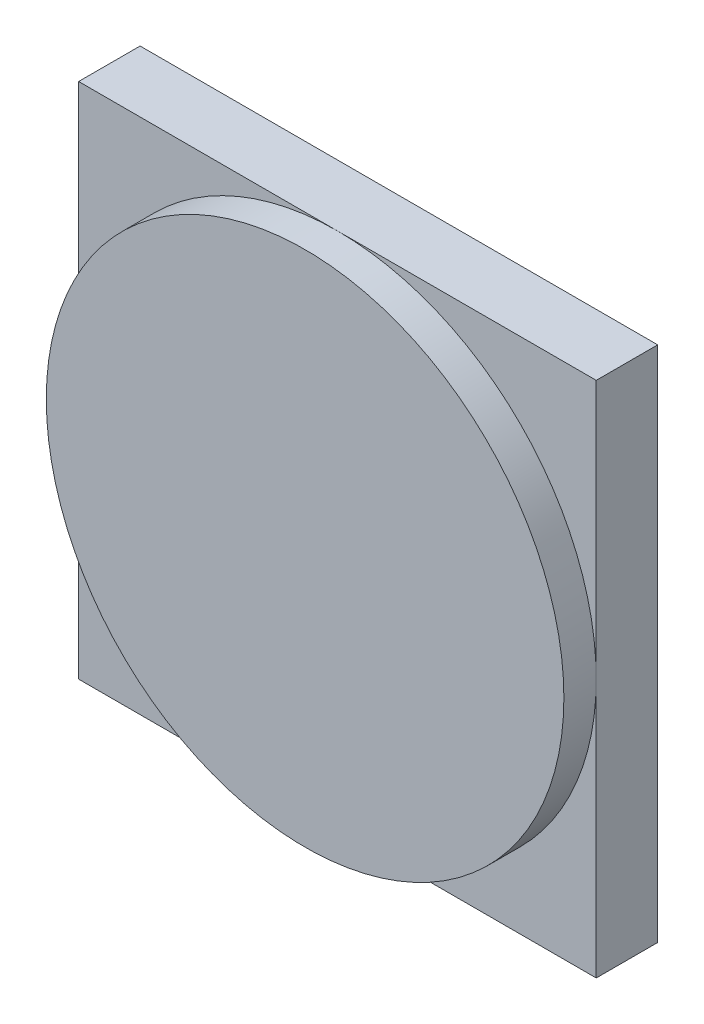
ISO-10303-21;
HEADER;
FILE_DESCRIPTION(('STEP AP214'),'2;1');
FILE_NAME('part.step','',(''),(''),'','','');
FILE_SCHEMA(('AUTOMOTIVE_DESIGN { 1 0 10303 214 1 1 1 1 }'));
ENDSEC;
DATA;
#1=APPLICATION_CONTEXT('core data for automotive mechanical design processes');
#2=APPLICATION_PROTOCOL_DEFINITION('international standard','automotive_design',2000,#1);
#3=PRODUCT_CONTEXT('',#1,'mechanical');
#4=PRODUCT('Part','Part','',(#3));
#5=PRODUCT_RELATED_PRODUCT_CATEGORY('part','',(#4));
#6=PRODUCT_DEFINITION_FORMATION('','',#4);
#7=PRODUCT_DEFINITION_CONTEXT('part definition',#1,'design');
#8=PRODUCT_DEFINITION('design','',#6,#7);
#9=PRODUCT_DEFINITION_SHAPE('','',#8);
#10=(LENGTH_UNIT() NAMED_UNIT(*) SI_UNIT(.MILLI.,.METRE.));
#11=(NAMED_UNIT(*) PLANE_ANGLE_UNIT() SI_UNIT($,.RADIAN.));
#12=(NAMED_UNIT(*) SI_UNIT($,.STERADIAN.) SOLID_ANGLE_UNIT());
#13=UNCERTAINTY_MEASURE_WITH_UNIT(LENGTH_MEASURE(1.E-05),#10,'distance_accuracy_value','');
#14=(GEOMETRIC_REPRESENTATION_CONTEXT(3) GLOBAL_UNCERTAINTY_ASSIGNED_CONTEXT((#13)) GLOBAL_UNIT_ASSIGNED_CONTEXT((#10,
#11,#12)) REPRESENTATION_CONTEXT('',''));
#15=CARTESIAN_POINT('',(0.,0.,0.));
#16=DIRECTION('',(0.,0.,1.));
#17=DIRECTION('',(1.,0.,0.));
#18=AXIS2_PLACEMENT_3D('',#15,#16,#17);
#19=CARTESIAN_POINT('',(0.,0.,5.));
#20=DIRECTION('',(0.,0.,-1.));
#21=DIRECTION('',(-1.,0.,0.));
#22=AXIS2_PLACEMENT_3D('',#19,#20,#21);
#23=CYLINDRICAL_SURFACE('',#22,40.);
#24=CARTESIAN_POINT('',(0.,0.,5.));
#25=DIRECTION('',(0.,0.,1.));
#26=DIRECTION('',(1.,0.,0.));
#27=AXIS2_PLACEMENT_3D('',#24,#25,#26);
#28=CIRCLE('',#27,40.);
#29=CARTESIAN_POINT('',(40.,0.,5.));
#30=VERTEX_POINT('',#29);
#31=EDGE_CURVE('E11',#30,#30,#28,.T.);
#32=ORIENTED_EDGE('',*,*,#31,.F.);
#33=EDGE_LOOP('',(#32));
#34=FACE_BOUND('',#33,.T.);
#35=CARTESIAN_POINT('',(0.,0.,0.));
#36=DIRECTION('',(0.,0.,1.));
#37=DIRECTION('',(1.,0.,0.));
#38=AXIS2_PLACEMENT_3D('',#35,#36,#37);
#39=CIRCLE('',#38,40.);
#40=CARTESIAN_POINT('',(40.,0.,0.));
#41=VERTEX_POINT('',#40);
#42=CARTESIAN_POINT('',(0.,40.,0.));
#43=VERTEX_POINT('',#42);
#44=EDGE_CURVE('E48',#41,#43,#39,.T.);
#45=ORIENTED_EDGE('',*,*,#44,.T.);
#46=CARTESIAN_POINT('',(-40.,0.,0.));
#47=VERTEX_POINT('',#46);
#48=EDGE_CURVE('E68',#43,#47,#39,.T.);
#49=ORIENTED_EDGE('',*,*,#48,.T.);
#50=CARTESIAN_POINT('',(0.,-40.,0.));
#51=VERTEX_POINT('',#50);
#52=EDGE_CURVE('E133',#47,#51,#39,.T.);
#53=ORIENTED_EDGE('',*,*,#52,.T.);
#54=EDGE_CURVE('E128',#51,#41,#39,.T.);
#55=ORIENTED_EDGE('',*,*,#54,.T.);
#56=EDGE_LOOP('',(#45,#49,#53,#55));
#57=FACE_BOUND('',#56,.T.);
#58=ADVANCED_FACE('F45',(#34,#57),#23,.T.);
#59=CARTESIAN_POINT('',(0.,0.,5.));
#60=DIRECTION('',(0.,0.,1.));
#61=DIRECTION('',(1.,0.,0.));
#62=AXIS2_PLACEMENT_3D('',#59,#60,#61);
#63=PLANE('',#62);
#64=ORIENTED_EDGE('',*,*,#31,.T.);
#65=EDGE_LOOP('',(#64));
#66=FACE_BOUND('',#65,.T.);
#67=ADVANCED_FACE('F192',(#66),#63,.T.);
#68=CARTESIAN_POINT('',(0.,0.,0.));
#69=DIRECTION('',(0.,0.,-1.));
#70=DIRECTION('',(-1.,0.,0.));
#71=AXIS2_PLACEMENT_3D('',#68,#69,#70);
#72=PLANE('',#71);
#73=ORIENTED_EDGE('',*,*,#44,.F.);
#74=DIRECTION('',(0.,-1.,0.));
#75=VECTOR('',#74,1.);
#76=CARTESIAN_POINT('',(40.,-40.,0.));
#77=LINE('',#76,#75);
#78=CARTESIAN_POINT('',(40.,40.,0.));
#79=VERTEX_POINT('',#78);
#80=EDGE_CURVE('E60',#79,#41,#77,.T.);
#81=ORIENTED_EDGE('',*,*,#80,.F.);
#82=DIRECTION('',(1.,0.,0.));
#83=VECTOR('',#82,1.);
#84=CARTESIAN_POINT('',(-40.,40.,0.));
#85=LINE('',#84,#83);
#86=EDGE_CURVE('E153',#43,#79,#85,.T.);
#87=ORIENTED_EDGE('',*,*,#86,.F.);
#88=EDGE_LOOP('',(#73,#81,#87));
#89=FACE_BOUND('',#88,.T.);
#90=ADVANCED_FACE('F180',(#89),#72,.F.);
#91=ORIENTED_EDGE('',*,*,#48,.F.);
#92=CARTESIAN_POINT('',(-40.,40.,0.));
#93=VERTEX_POINT('',#92);
#94=EDGE_CURVE('E150',#93,#43,#85,.T.);
#95=ORIENTED_EDGE('',*,*,#94,.F.);
#96=DIRECTION('',(0.,1.,0.));
#97=VECTOR('',#96,1.);
#98=CARTESIAN_POINT('',(-40.,-40.,0.));
#99=LINE('',#98,#97);
#100=EDGE_CURVE('E126',#47,#93,#99,.T.);
#101=ORIENTED_EDGE('',*,*,#100,.F.);
#102=EDGE_LOOP('',(#91,#95,#101));
#103=FACE_BOUND('',#102,.T.);
#104=ADVANCED_FACE('F172',(#103),#72,.F.);
#105=ORIENTED_EDGE('',*,*,#52,.F.);
#106=CARTESIAN_POINT('',(-40.,-40.,0.));
#107=VERTEX_POINT('',#106);
#108=EDGE_CURVE('E154',#107,#47,#99,.T.);
#109=ORIENTED_EDGE('',*,*,#108,.F.);
#110=DIRECTION('',(-1.,0.,0.));
#111=VECTOR('',#110,1.);
#112=CARTESIAN_POINT('',(-40.,-40.,0.));
#113=LINE('',#112,#111);
#114=EDGE_CURVE('E146',#51,#107,#113,.T.);
#115=ORIENTED_EDGE('',*,*,#114,.F.);
#116=EDGE_LOOP('',(#105,#109,#115));
#117=FACE_BOUND('',#116,.T.);
#118=ADVANCED_FACE('F168',(#117),#72,.F.);
#119=CARTESIAN_POINT('',(-40.,-40.,-9.5));
#120=DIRECTION('',(1.,0.,0.));
#121=DIRECTION('',(0.,1.,0.));
#122=AXIS2_PLACEMENT_3D('',#119,#120,#121);
#123=PLANE('',#122);
#124=ORIENTED_EDGE('',*,*,#108,.T.);
#125=ORIENTED_EDGE('',*,*,#100,.T.);
#126=DIRECTION('',(0.,0.,1.));
#127=VECTOR('',#126,1.);
#128=CARTESIAN_POINT('',(-40.,40.,-9.5));
#129=LINE('',#128,#127);
#130=CARTESIAN_POINT('',(-40.,40.,-9.5));
#131=VERTEX_POINT('',#130);
#132=EDGE_CURVE('E106',#131,#93,#129,.T.);
#133=ORIENTED_EDGE('',*,*,#132,.F.);
#134=DIRECTION('',(0.,1.,0.));
#135=VECTOR('',#134,1.);
#136=CARTESIAN_POINT('',(-40.,-40.,-9.5));
#137=LINE('',#136,#135);
#138=CARTESIAN_POINT('',(-40.,-40.,-9.5));
#139=VERTEX_POINT('',#138);
#140=EDGE_CURVE('E112',#139,#131,#137,.T.);
#141=ORIENTED_EDGE('',*,*,#140,.F.);
#142=DIRECTION('',(0.,0.,1.));
#143=VECTOR('',#142,1.);
#144=CARTESIAN_POINT('',(-40.,-40.,-9.5));
#145=LINE('',#144,#143);
#146=EDGE_CURVE('E140',#139,#107,#145,.T.);
#147=ORIENTED_EDGE('',*,*,#146,.T.);
#148=EDGE_LOOP('',(#124,#125,#133,#141,#147));
#149=FACE_BOUND('',#148,.T.);
#150=ADVANCED_FACE('F125',(#149),#123,.F.);
#151=CARTESIAN_POINT('',(-40.,40.,-9.5));
#152=DIRECTION('',(0.,-1.,0.));
#153=DIRECTION('',(0.,0.,-1.));
#154=AXIS2_PLACEMENT_3D('',#151,#152,#153);
#155=PLANE('',#154);
#156=ORIENTED_EDGE('',*,*,#94,.T.);
#157=ORIENTED_EDGE('',*,*,#86,.T.);
#158=DIRECTION('',(0.,0.,1.));
#159=VECTOR('',#158,1.);
#160=CARTESIAN_POINT('',(40.,40.,-9.5));
#161=LINE('',#160,#159);
#162=CARTESIAN_POINT('',(40.,40.,-9.5));
#163=VERTEX_POINT('',#162);
#164=EDGE_CURVE('E107',#163,#79,#161,.T.);
#165=ORIENTED_EDGE('',*,*,#164,.F.);
#166=DIRECTION('',(1.,0.,0.));
#167=VECTOR('',#166,1.);
#168=CARTESIAN_POINT('',(-40.,40.,-9.5));
#169=LINE('',#168,#167);
#170=EDGE_CURVE('E101',#131,#163,#169,.T.);
#171=ORIENTED_EDGE('',*,*,#170,.F.);
#172=ORIENTED_EDGE('',*,*,#132,.T.);
#173=EDGE_LOOP('',(#156,#157,#165,#171,#172));
#174=FACE_BOUND('',#173,.T.);
#175=ADVANCED_FACE('F104',(#174),#155,.F.);
#176=CARTESIAN_POINT('',(40.,-40.,-9.5));
#177=DIRECTION('',(-1.,0.,0.));
#178=DIRECTION('',(0.,-1.,0.));
#179=AXIS2_PLACEMENT_3D('',#176,#177,#178);
#180=PLANE('',#179);
#181=ORIENTED_EDGE('',*,*,#80,.T.);
#182=CARTESIAN_POINT('',(40.,-40.,0.));
#183=VERTEX_POINT('',#182);
#184=EDGE_CURVE('E149',#41,#183,#77,.T.);
#185=ORIENTED_EDGE('',*,*,#184,.T.);
#186=DIRECTION('',(0.,0.,1.));
#187=VECTOR('',#186,1.);
#188=CARTESIAN_POINT('',(40.,-40.,-9.5));
#189=LINE('',#188,#187);
#190=CARTESIAN_POINT('',(40.,-40.,-9.5));
#191=VERTEX_POINT('',#190);
#192=EDGE_CURVE('E134',#191,#183,#189,.T.);
#193=ORIENTED_EDGE('',*,*,#192,.F.);
#194=DIRECTION('',(0.,-1.,0.));
#195=VECTOR('',#194,1.);
#196=CARTESIAN_POINT('',(40.,-40.,-9.5));
#197=LINE('',#196,#195);
#198=EDGE_CURVE('E111',#163,#191,#197,.T.);
#199=ORIENTED_EDGE('',*,*,#198,.F.);
#200=ORIENTED_EDGE('',*,*,#164,.T.);
#201=EDGE_LOOP('',(#181,#185,#193,#199,#200));
#202=FACE_BOUND('',#201,.T.);
#203=ADVANCED_FACE('F161',(#202),#180,.F.);
#204=CARTESIAN_POINT('',(-40.,-40.,-9.5));
#205=DIRECTION('',(0.,1.,0.));
#206=DIRECTION('',(0.,0.,1.));
#207=AXIS2_PLACEMENT_3D('',#204,#205,#206);
#208=PLANE('',#207);
#209=EDGE_CURVE('E122',#183,#51,#113,.T.);
#210=ORIENTED_EDGE('',*,*,#209,.T.);
#211=ORIENTED_EDGE('',*,*,#114,.T.);
#212=ORIENTED_EDGE('',*,*,#146,.F.);
#213=DIRECTION('',(-1.,0.,0.));
#214=VECTOR('',#213,1.);
#215=CARTESIAN_POINT('',(-40.,-40.,-9.5));
#216=LINE('',#215,#214);
#217=EDGE_CURVE('E117',#191,#139,#216,.T.);
#218=ORIENTED_EDGE('',*,*,#217,.F.);
#219=ORIENTED_EDGE('',*,*,#192,.T.);
#220=EDGE_LOOP('',(#210,#211,#212,#218,#219));
#221=FACE_BOUND('',#220,.T.);
#222=ADVANCED_FACE('F164',(#221),#208,.F.);
#223=CARTESIAN_POINT('',(0.,0.,-9.5));
#224=DIRECTION('',(0.,0.,-1.));
#225=DIRECTION('',(-1.,0.,0.));
#226=AXIS2_PLACEMENT_3D('',#223,#224,#225);
#227=PLANE('',#226);
#228=ORIENTED_EDGE('',*,*,#140,.T.);
#229=ORIENTED_EDGE('',*,*,#170,.T.);
#230=ORIENTED_EDGE('',*,*,#198,.T.);
#231=ORIENTED_EDGE('',*,*,#217,.T.);
#232=EDGE_LOOP('',(#228,#229,#230,#231));
#233=FACE_BOUND('',#232,.T.);
#234=ADVANCED_FACE('F115',(#233),#227,.T.);
#235=ORIENTED_EDGE('',*,*,#54,.F.);
#236=ORIENTED_EDGE('',*,*,#209,.F.);
#237=ORIENTED_EDGE('',*,*,#184,.F.);
#238=EDGE_LOOP('',(#235,#236,#237));
#239=FACE_BOUND('',#238,.T.);
#240=ADVANCED_FACE('F183',(#239),#72,.F.);
#241=CLOSED_SHELL('',(#58,#67,#90,#104,#118,#150,#175,#203,#222,#234,#240));
#242=MANIFOLD_SOLID_BREP('B2',#241);
#243=ADVANCED_BREP_SHAPE_REPRESENTATION('',(#18,#242),#14);
#244=SHAPE_DEFINITION_REPRESENTATION(#9,#243);
ENDSEC;
END-ISO-10303-21;
